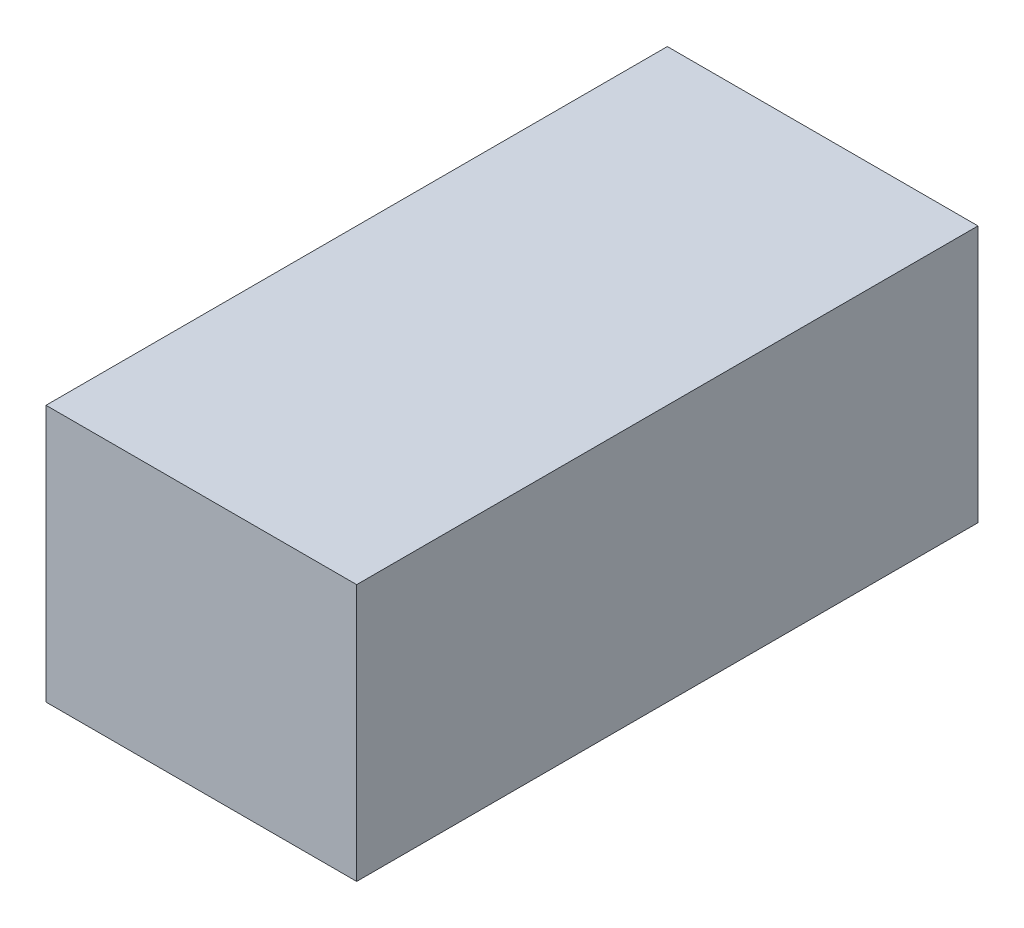
ISO-10303-21;
HEADER;
FILE_DESCRIPTION(('STEP AP214'),'2;1');
FILE_NAME('part.step','',(''),(''),'','','');
FILE_SCHEMA(('AUTOMOTIVE_DESIGN { 1 0 10303 214 1 1 1 1 }'));
ENDSEC;
DATA;
#1=APPLICATION_CONTEXT('core data for automotive mechanical design processes');
#2=APPLICATION_PROTOCOL_DEFINITION('international standard','automotive_design',2000,#1);
#3=PRODUCT_CONTEXT('',#1,'mechanical');
#4=PRODUCT('Part','Part','',(#3));
#5=PRODUCT_RELATED_PRODUCT_CATEGORY('part','',(#4));
#6=PRODUCT_DEFINITION_FORMATION('','',#4);
#7=PRODUCT_DEFINITION_CONTEXT('part definition',#1,'design');
#8=PRODUCT_DEFINITION('design','',#6,#7);
#9=PRODUCT_DEFINITION_SHAPE('','',#8);
#10=(LENGTH_UNIT() NAMED_UNIT(*) SI_UNIT(.MILLI.,.METRE.));
#11=(NAMED_UNIT(*) PLANE_ANGLE_UNIT() SI_UNIT($,.RADIAN.));
#12=(NAMED_UNIT(*) SI_UNIT($,.STERADIAN.) SOLID_ANGLE_UNIT());
#13=UNCERTAINTY_MEASURE_WITH_UNIT(LENGTH_MEASURE(1.E-05),#10,'distance_accuracy_value','');
#14=(GEOMETRIC_REPRESENTATION_CONTEXT(3) GLOBAL_UNCERTAINTY_ASSIGNED_CONTEXT((#13)) GLOBAL_UNIT_ASSIGNED_CONTEXT((#10,
#11,#12)) REPRESENTATION_CONTEXT('',''));
#15=CARTESIAN_POINT('',(0.,0.,0.));
#16=DIRECTION('',(0.,0.,1.));
#17=DIRECTION('',(1.,0.,0.));
#18=AXIS2_PLACEMENT_3D('',#15,#16,#17);
#19=CARTESIAN_POINT('',(-0.800000000000009,2.8,1.));
#20=DIRECTION('',(0.,-1.,0.));
#21=DIRECTION('',(0.,0.,-1.));
#22=AXIS2_PLACEMENT_3D('',#19,#20,#21);
#23=PLANE('',#22);
#24=DIRECTION('',(-1.,0.,0.));
#25=VECTOR('',#24,1.);
#26=CARTESIAN_POINT('',(-0.800000000000009,2.8,0.));
#27=LINE('',#26,#25);
#28=CARTESIAN_POINT('',(-0.300000000000009,2.8,0.));
#29=VERTEX_POINT('',#28);
#30=CARTESIAN_POINT('',(-0.800000000000009,2.8,0.));
#31=VERTEX_POINT('',#30);
#32=EDGE_CURVE('E94',#29,#31,#27,.T.);
#33=ORIENTED_EDGE('',*,*,#32,.T.);
#34=DIRECTION('',(0.,0.,-1.));
#35=VECTOR('',#34,1.);
#36=CARTESIAN_POINT('',(-0.800000000000009,2.8,1.));
#37=LINE('',#36,#35);
#38=CARTESIAN_POINT('',(-0.800000000000009,2.8,1.));
#39=VERTEX_POINT('',#38);
#40=EDGE_CURVE('E11',#39,#31,#37,.T.);
#41=ORIENTED_EDGE('',*,*,#40,.F.);
#42=DIRECTION('',(-1.,0.,0.));
#43=VECTOR('',#42,1.);
#44=CARTESIAN_POINT('',(-0.800000000000009,2.8,1.));
#45=LINE('',#44,#43);
#46=CARTESIAN_POINT('',(-0.300000000000009,2.8,1.));
#47=VERTEX_POINT('',#46);
#48=EDGE_CURVE('E82',#47,#39,#45,.T.);
#49=ORIENTED_EDGE('',*,*,#48,.F.);
#50=DIRECTION('',(0.,0.,-1.));
#51=VECTOR('',#50,1.);
#52=CARTESIAN_POINT('',(-0.300000000000009,2.8,1.));
#53=LINE('',#52,#51);
#54=EDGE_CURVE('E90',#47,#29,#53,.T.);
#55=ORIENTED_EDGE('',*,*,#54,.T.);
#56=EDGE_LOOP('',(#33,#41,#49,#55));
#57=FACE_BOUND('',#56,.T.);
#58=ADVANCED_FACE('F31',(#57),#23,.F.);
#59=CARTESIAN_POINT('',(-0.800000000000009,2.8,1.));
#60=DIRECTION('',(1.,0.,0.));
#61=DIRECTION('',(0.,0.,-1.));
#62=AXIS2_PLACEMENT_3D('',#59,#60,#61);
#63=PLANE('',#62);
#64=DIRECTION('',(0.,-1.,0.));
#65=VECTOR('',#64,1.);
#66=CARTESIAN_POINT('',(-0.800000000000009,2.8,0.));
#67=LINE('',#66,#65);
#68=CARTESIAN_POINT('',(-0.800000000000009,2.38627381885763,0.));
#69=VERTEX_POINT('',#68);
#70=EDGE_CURVE('E86',#31,#69,#67,.T.);
#71=ORIENTED_EDGE('',*,*,#70,.T.);
#72=DIRECTION('',(0.,0.,-1.));
#73=VECTOR('',#72,1.);
#74=CARTESIAN_POINT('',(-0.800000000000009,2.38627381885763,1.));
#75=LINE('',#74,#73);
#76=CARTESIAN_POINT('',(-0.800000000000009,2.38627381885763,1.));
#77=VERTEX_POINT('',#76);
#78=EDGE_CURVE('E39',#77,#69,#75,.T.);
#79=ORIENTED_EDGE('',*,*,#78,.F.);
#80=DIRECTION('',(0.,-1.,0.));
#81=VECTOR('',#80,1.);
#82=CARTESIAN_POINT('',(-0.800000000000009,2.8,1.));
#83=LINE('',#82,#81);
#84=EDGE_CURVE('E77',#39,#77,#83,.T.);
#85=ORIENTED_EDGE('',*,*,#84,.F.);
#86=ORIENTED_EDGE('',*,*,#40,.T.);
#87=EDGE_LOOP('',(#71,#79,#85,#86));
#88=FACE_BOUND('',#87,.T.);
#89=ADVANCED_FACE('F85',(#88),#63,.F.);
#90=CARTESIAN_POINT('',(-0.800000000000009,2.38627381885763,1.));
#91=DIRECTION('',(0.,1.,0.));
#92=DIRECTION('',(0.,0.,1.));
#93=AXIS2_PLACEMENT_3D('',#90,#91,#92);
#94=PLANE('',#93);
#95=DIRECTION('',(1.,0.,0.));
#96=VECTOR('',#95,1.);
#97=CARTESIAN_POINT('',(-0.800000000000009,2.38627381885763,0.));
#98=LINE('',#97,#96);
#99=CARTESIAN_POINT('',(-0.300000000000009,2.38627381885763,0.));
#100=VERTEX_POINT('',#99);
#101=EDGE_CURVE('E64',#69,#100,#98,.T.);
#102=ORIENTED_EDGE('',*,*,#101,.T.);
#103=DIRECTION('',(0.,0.,-1.));
#104=VECTOR('',#103,1.);
#105=CARTESIAN_POINT('',(-0.300000000000009,2.38627381885763,1.));
#106=LINE('',#105,#104);
#107=CARTESIAN_POINT('',(-0.300000000000009,2.38627381885763,1.));
#108=VERTEX_POINT('',#107);
#109=EDGE_CURVE('E87',#108,#100,#106,.T.);
#110=ORIENTED_EDGE('',*,*,#109,.F.);
#111=DIRECTION('',(1.,0.,0.));
#112=VECTOR('',#111,1.);
#113=CARTESIAN_POINT('',(-0.800000000000009,2.38627381885763,1.));
#114=LINE('',#113,#112);
#115=EDGE_CURVE('E80',#77,#108,#114,.T.);
#116=ORIENTED_EDGE('',*,*,#115,.F.);
#117=ORIENTED_EDGE('',*,*,#78,.T.);
#118=EDGE_LOOP('',(#102,#110,#116,#117));
#119=FACE_BOUND('',#118,.T.);
#120=ADVANCED_FACE('F88',(#119),#94,.F.);
#121=CARTESIAN_POINT('',(-0.300000000000009,2.8,1.));
#122=DIRECTION('',(-1.,0.,0.));
#123=DIRECTION('',(0.,0.,1.));
#124=AXIS2_PLACEMENT_3D('',#121,#122,#123);
#125=PLANE('',#124);
#126=DIRECTION('',(0.,1.,0.));
#127=VECTOR('',#126,1.);
#128=CARTESIAN_POINT('',(-0.300000000000009,2.8,0.));
#129=LINE('',#128,#127);
#130=EDGE_CURVE('E70',#100,#29,#129,.T.);
#131=ORIENTED_EDGE('',*,*,#130,.T.);
#132=ORIENTED_EDGE('',*,*,#54,.F.);
#133=DIRECTION('',(0.,1.,0.));
#134=VECTOR('',#133,1.);
#135=CARTESIAN_POINT('',(-0.300000000000009,2.8,1.));
#136=LINE('',#135,#134);
#137=EDGE_CURVE('E47',#108,#47,#136,.T.);
#138=ORIENTED_EDGE('',*,*,#137,.F.);
#139=ORIENTED_EDGE('',*,*,#109,.T.);
#140=EDGE_LOOP('',(#131,#132,#138,#139));
#141=FACE_BOUND('',#140,.T.);
#142=ADVANCED_FACE('F101',(#141),#125,.F.);
#143=CARTESIAN_POINT('',(-0.300000000000009,2.8,1.));
#144=DIRECTION('',(0.,0.,-1.));
#145=DIRECTION('',(-1.,0.,0.));
#146=AXIS2_PLACEMENT_3D('',#143,#144,#145);
#147=PLANE('',#146);
#148=ORIENTED_EDGE('',*,*,#48,.T.);
#149=ORIENTED_EDGE('',*,*,#84,.T.);
#150=ORIENTED_EDGE('',*,*,#115,.T.);
#151=ORIENTED_EDGE('',*,*,#137,.T.);
#152=EDGE_LOOP('',(#148,#149,#150,#151));
#153=FACE_BOUND('',#152,.T.);
#154=ADVANCED_FACE('F78',(#153),#147,.F.);
#155=CARTESIAN_POINT('',(-0.300000000000009,2.8,0.));
#156=DIRECTION('',(0.,0.,-1.));
#157=DIRECTION('',(-1.,0.,0.));
#158=AXIS2_PLACEMENT_3D('',#155,#156,#157);
#159=PLANE('',#158);
#160=ORIENTED_EDGE('',*,*,#32,.F.);
#161=ORIENTED_EDGE('',*,*,#130,.F.);
#162=ORIENTED_EDGE('',*,*,#101,.F.);
#163=ORIENTED_EDGE('',*,*,#70,.F.);
#164=EDGE_LOOP('',(#160,#161,#162,#163));
#165=FACE_BOUND('',#164,.T.);
#166=ADVANCED_FACE('F104',(#165),#159,.T.);
#167=CLOSED_SHELL('',(#58,#89,#120,#142,#154,#166));
#168=MANIFOLD_SOLID_BREP('B2',#167);
#169=ADVANCED_BREP_SHAPE_REPRESENTATION('',(#18,#168),#14);
#170=SHAPE_DEFINITION_REPRESENTATION(#9,#169);
ENDSEC;
END-ISO-10303-21;
